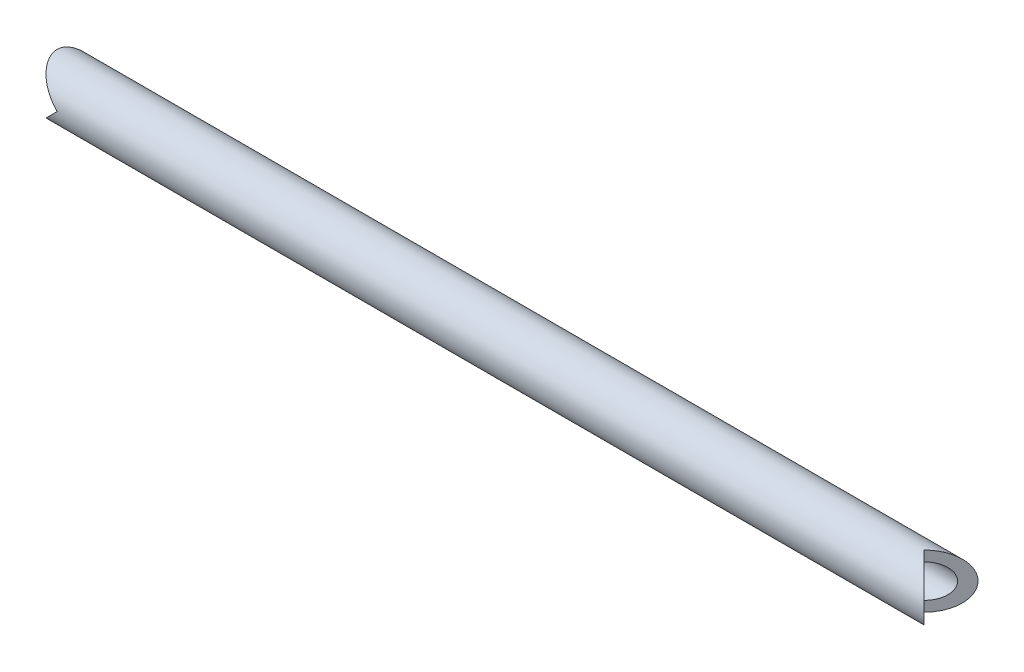
ISO-10303-21;
HEADER;
FILE_DESCRIPTION(('STEP AP214'),'2;1');
FILE_NAME('part.step','',(''),(''),'','','');
FILE_SCHEMA(('AUTOMOTIVE_DESIGN { 1 0 10303 214 1 1 1 1 }'));
ENDSEC;
DATA;
#1=APPLICATION_CONTEXT('core data for automotive mechanical design processes');
#2=APPLICATION_PROTOCOL_DEFINITION('international standard','automotive_design',2000,#1);
#3=PRODUCT_CONTEXT('',#1,'mechanical');
#4=PRODUCT('Part','Part','',(#3));
#5=PRODUCT_RELATED_PRODUCT_CATEGORY('part','',(#4));
#6=PRODUCT_DEFINITION_FORMATION('','',#4);
#7=PRODUCT_DEFINITION_CONTEXT('part definition',#1,'design');
#8=PRODUCT_DEFINITION('design','',#6,#7);
#9=PRODUCT_DEFINITION_SHAPE('','',#8);
#10=(LENGTH_UNIT() NAMED_UNIT(*) SI_UNIT(.MILLI.,.METRE.));
#11=(NAMED_UNIT(*) PLANE_ANGLE_UNIT() SI_UNIT($,.RADIAN.));
#12=(NAMED_UNIT(*) SI_UNIT($,.STERADIAN.) SOLID_ANGLE_UNIT());
#13=UNCERTAINTY_MEASURE_WITH_UNIT(LENGTH_MEASURE(1.E-05),#10,'distance_accuracy_value','');
#14=(GEOMETRIC_REPRESENTATION_CONTEXT(3) GLOBAL_UNCERTAINTY_ASSIGNED_CONTEXT((#13)) GLOBAL_UNIT_ASSIGNED_CONTEXT((#10,
#11,#12)) REPRESENTATION_CONTEXT('',''));
#15=CARTESIAN_POINT('',(0.,0.,0.));
#16=DIRECTION('',(0.,0.,1.));
#17=DIRECTION('',(1.,0.,0.));
#18=AXIS2_PLACEMENT_3D('',#15,#16,#17);
#19=CARTESIAN_POINT('',(66.675,0.,0.));
#20=DIRECTION('',(-1.,0.,0.));
#21=DIRECTION('',(0.,0.,1.));
#22=AXIS2_PLACEMENT_3D('',#19,#20,#21);
#23=CYLINDRICAL_SURFACE('',#22,2.0066);
#24=CARTESIAN_POINT('',(2.00660000000001,0.,0.));
#25=DIRECTION('',(0.707106781186546,0.707106781186549,0.));
#26=DIRECTION('',(-0.707106781186549,0.707106781186546,0.));
#27=AXIS2_PLACEMENT_3D('',#24,#25,#26);
#28=ELLIPSE('',#27,2.83776093425786,2.0066);
#29=CARTESIAN_POINT('',(2.00660000000001,0.,-2.0066));
#30=VERTEX_POINT('',#29);
#31=CARTESIAN_POINT('',(2.00660000000001,0.,2.0066));
#32=VERTEX_POINT('',#31);
#33=EDGE_CURVE('E119',#30,#32,#28,.T.);
#34=ORIENTED_EDGE('',*,*,#33,.T.);
#35=CARTESIAN_POINT('',(2.00660000000001,0.,0.));
#36=DIRECTION('',(0.707106781186546,-0.707106781186549,0.));
#37=DIRECTION('',(-0.707106781186549,-0.707106781186546,0.));
#38=AXIS2_PLACEMENT_3D('',#35,#36,#37);
#39=ELLIPSE('',#38,2.83776093425786,2.0066);
#40=EDGE_CURVE('E116',#32,#30,#39,.T.);
#41=ORIENTED_EDGE('',*,*,#40,.T.);
#42=EDGE_LOOP('',(#34,#41));
#43=FACE_BOUND('',#42,.T.);
#44=CARTESIAN_POINT('',(64.6684,0.,0.));
#45=DIRECTION('',(0.707106781186545,0.,0.707106781186549));
#46=DIRECTION('',(-0.70710678118655,0.,0.707106781186546));
#47=AXIS2_PLACEMENT_3D('',#44,#45,#46);
#48=ELLIPSE('',#47,2.83776093425786,2.0066);
#49=CARTESIAN_POINT('',(64.6684,-2.0066,0.));
#50=VERTEX_POINT('',#49);
#51=CARTESIAN_POINT('',(64.6684,2.0066,0.));
#52=VERTEX_POINT('',#51);
#53=EDGE_CURVE('E100',#50,#52,#48,.T.);
#54=ORIENTED_EDGE('',*,*,#53,.F.);
#55=CARTESIAN_POINT('',(64.6684,0.,0.));
#56=DIRECTION('',(0.707106781186545,0.,-0.707106781186549));
#57=DIRECTION('',(-0.70710678118655,0.,-0.707106781186546));
#58=AXIS2_PLACEMENT_3D('',#55,#56,#57);
#59=ELLIPSE('',#58,2.83776093425786,2.0066);
#60=EDGE_CURVE('E93',#52,#50,#59,.T.);
#61=ORIENTED_EDGE('',*,*,#60,.F.);
#62=EDGE_LOOP('',(#54,#61));
#63=FACE_BOUND('',#62,.T.);
#64=ADVANCED_FACE('F52',(#43,#63),#23,.T.);
#65=CARTESIAN_POINT('',(66.675,0.,0.));
#66=DIRECTION('',(-1.,0.,0.));
#67=DIRECTION('',(0.,0.,1.));
#68=AXIS2_PLACEMENT_3D('',#65,#66,#67);
#69=CYLINDRICAL_SURFACE('',#68,1.2446);
#70=CARTESIAN_POINT('',(2.00660000000001,0.,0.));
#71=DIRECTION('',(0.707106781186546,0.707106781186549,0.));
#72=DIRECTION('',(-0.707106781186549,0.707106781186546,0.));
#73=AXIS2_PLACEMENT_3D('',#70,#71,#72);
#74=ELLIPSE('',#73,1.76013019972956,1.2446);
#75=CARTESIAN_POINT('',(2.00660000000001,0.,-1.2446));
#76=VERTEX_POINT('',#75);
#77=CARTESIAN_POINT('',(2.00660000000001,0.,1.2446));
#78=VERTEX_POINT('',#77);
#79=EDGE_CURVE('E125',#76,#78,#74,.T.);
#80=ORIENTED_EDGE('',*,*,#79,.F.);
#81=CARTESIAN_POINT('',(2.00660000000001,0.,0.));
#82=DIRECTION('',(0.707106781186546,-0.707106781186549,0.));
#83=DIRECTION('',(-0.707106781186549,-0.707106781186546,0.));
#84=AXIS2_PLACEMENT_3D('',#81,#82,#83);
#85=ELLIPSE('',#84,1.76013019972956,1.2446);
#86=EDGE_CURVE('E122',#78,#76,#85,.T.);
#87=ORIENTED_EDGE('',*,*,#86,.F.);
#88=EDGE_LOOP('',(#80,#87));
#89=FACE_BOUND('',#88,.T.);
#90=CARTESIAN_POINT('',(64.6684,0.,0.));
#91=DIRECTION('',(0.707106781186545,0.,-0.707106781186549));
#92=DIRECTION('',(-0.70710678118655,0.,-0.707106781186546));
#93=AXIS2_PLACEMENT_3D('',#90,#91,#92);
#94=ELLIPSE('',#93,1.76013019972956,1.2446);
#95=CARTESIAN_POINT('',(64.6684,1.2446,0.));
#96=VERTEX_POINT('',#95);
#97=CARTESIAN_POINT('',(64.6684,-1.2446,0.));
#98=VERTEX_POINT('',#97);
#99=EDGE_CURVE('E60',#96,#98,#94,.T.);
#100=ORIENTED_EDGE('',*,*,#99,.T.);
#101=CARTESIAN_POINT('',(64.6684,0.,0.));
#102=DIRECTION('',(0.707106781186545,0.,0.707106781186549));
#103=DIRECTION('',(-0.70710678118655,0.,0.707106781186546));
#104=AXIS2_PLACEMENT_3D('',#101,#102,#103);
#105=ELLIPSE('',#104,1.76013019972956,1.2446);
#106=EDGE_CURVE('E13',#98,#96,#105,.T.);
#107=ORIENTED_EDGE('',*,*,#106,.T.);
#108=EDGE_LOOP('',(#100,#107));
#109=FACE_BOUND('',#108,.T.);
#110=ADVANCED_FACE('F130',(#89,#109),#69,.F.);
#111=CARTESIAN_POINT('',(0.,2.0066,-2.0066));
#112=DIRECTION('',(0.707106781186546,0.707106781186549,0.));
#113=DIRECTION('',(-0.707106781186549,0.707106781186546,0.));
#114=AXIS2_PLACEMENT_3D('',#111,#112,#113);
#115=PLANE('',#114);
#116=ORIENTED_EDGE('',*,*,#33,.F.);
#117=DIRECTION('',(0.,0.,1.));
#118=VECTOR('',#117,1.);
#119=CARTESIAN_POINT('',(2.00660000000001,0.,-2.0066));
#120=LINE('',#119,#118);
#121=EDGE_CURVE('E111',#30,#76,#120,.T.);
#122=ORIENTED_EDGE('',*,*,#121,.T.);
#123=ORIENTED_EDGE('',*,*,#79,.T.);
#124=EDGE_CURVE('E75',#78,#32,#120,.T.);
#125=ORIENTED_EDGE('',*,*,#124,.T.);
#126=EDGE_LOOP('',(#116,#122,#123,#125));
#127=FACE_BOUND('',#126,.T.);
#128=ADVANCED_FACE('F136',(#127),#115,.F.);
#129=CARTESIAN_POINT('',(2.00660000000001,0.,-2.0066));
#130=DIRECTION('',(0.707106781186546,-0.707106781186549,0.));
#131=DIRECTION('',(0.707106781186549,0.707106781186546,0.));
#132=AXIS2_PLACEMENT_3D('',#129,#130,#131);
#133=PLANE('',#132);
#134=ORIENTED_EDGE('',*,*,#40,.F.);
#135=ORIENTED_EDGE('',*,*,#124,.F.);
#136=ORIENTED_EDGE('',*,*,#86,.T.);
#137=ORIENTED_EDGE('',*,*,#121,.F.);
#138=EDGE_LOOP('',(#134,#135,#136,#137));
#139=FACE_BOUND('',#138,.T.);
#140=ADVANCED_FACE('F142',(#139),#133,.F.);
#141=CARTESIAN_POINT('',(66.675,2.0066,-2.0066));
#142=DIRECTION('',(0.707106781186545,0.,0.707106781186549));
#143=DIRECTION('',(0.70710678118655,0.,-0.707106781186546));
#144=AXIS2_PLACEMENT_3D('',#141,#142,#143);
#145=PLANE('',#144);
#146=ORIENTED_EDGE('',*,*,#53,.T.);
#147=DIRECTION('',(0.,-1.,0.));
#148=VECTOR('',#147,1.);
#149=CARTESIAN_POINT('',(64.6684,2.0066,0.));
#150=LINE('',#149,#148);
#151=EDGE_CURVE('E96',#52,#96,#150,.T.);
#152=ORIENTED_EDGE('',*,*,#151,.T.);
#153=ORIENTED_EDGE('',*,*,#106,.F.);
#154=EDGE_CURVE('E67',#98,#50,#150,.T.);
#155=ORIENTED_EDGE('',*,*,#154,.T.);
#156=EDGE_LOOP('',(#146,#152,#153,#155));
#157=FACE_BOUND('',#156,.T.);
#158=ADVANCED_FACE('F103',(#157),#145,.T.);
#159=CARTESIAN_POINT('',(64.6684,2.0066,0.));
#160=DIRECTION('',(0.707106781186545,0.,-0.707106781186549));
#161=DIRECTION('',(-0.70710678118655,0.,-0.707106781186546));
#162=AXIS2_PLACEMENT_3D('',#159,#160,#161);
#163=PLANE('',#162);
#164=ORIENTED_EDGE('',*,*,#60,.T.);
#165=ORIENTED_EDGE('',*,*,#154,.F.);
#166=ORIENTED_EDGE('',*,*,#99,.F.);
#167=ORIENTED_EDGE('',*,*,#151,.F.);
#168=EDGE_LOOP('',(#164,#165,#166,#167));
#169=FACE_BOUND('',#168,.T.);
#170=ADVANCED_FACE('F94',(#169),#163,.T.);
#171=CLOSED_SHELL('',(#64,#110,#128,#140,#158,#170));
#172=MANIFOLD_SOLID_BREP('B2',#171);
#173=ADVANCED_BREP_SHAPE_REPRESENTATION('',(#18,#172),#14);
#174=SHAPE_DEFINITION_REPRESENTATION(#9,#173);
ENDSEC;
END-ISO-10303-21;
